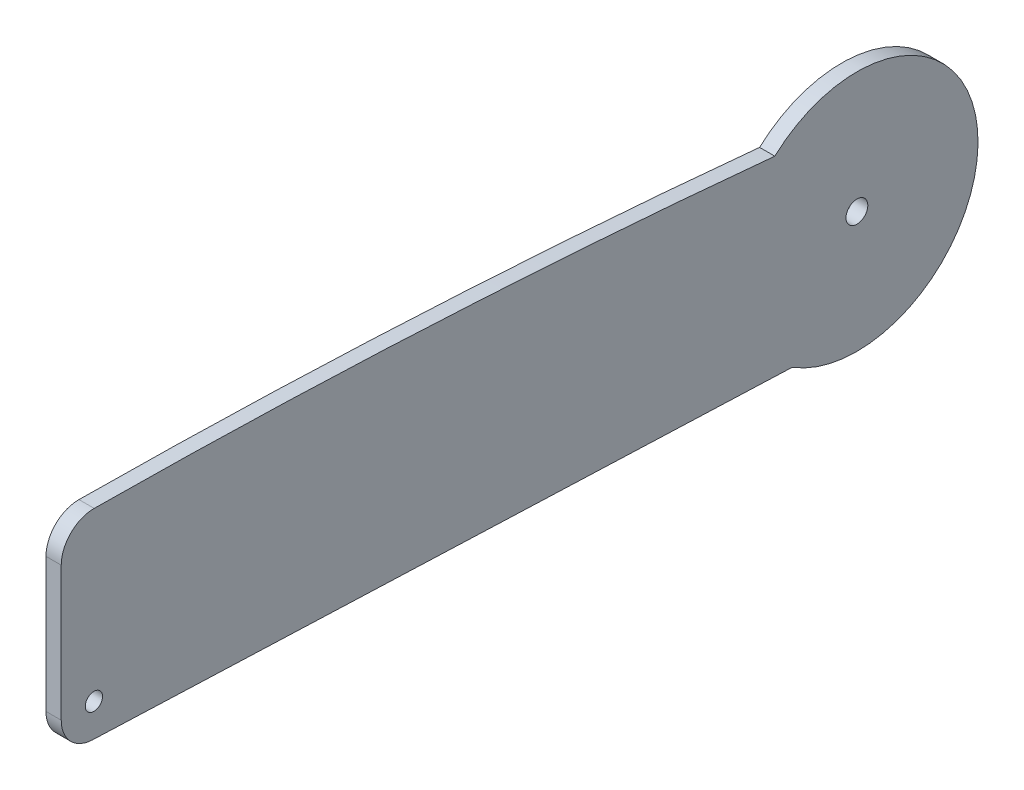
ISO-10303-21;
HEADER;
FILE_DESCRIPTION(('STEP AP214'),'2;1');
FILE_NAME('part.step','',(''),(''),'','','');
FILE_SCHEMA(('AUTOMOTIVE_DESIGN { 1 0 10303 214 1 1 1 1 }'));
ENDSEC;
DATA;
#1=APPLICATION_CONTEXT('core data for automotive mechanical design processes');
#2=APPLICATION_PROTOCOL_DEFINITION('international standard','automotive_design',2000,#1);
#3=PRODUCT_CONTEXT('',#1,'mechanical');
#4=PRODUCT('Part','Part','',(#3));
#5=PRODUCT_RELATED_PRODUCT_CATEGORY('part','',(#4));
#6=PRODUCT_DEFINITION_FORMATION('','',#4);
#7=PRODUCT_DEFINITION_CONTEXT('part definition',#1,'design');
#8=PRODUCT_DEFINITION('design','',#6,#7);
#9=PRODUCT_DEFINITION_SHAPE('','',#8);
#10=(LENGTH_UNIT() NAMED_UNIT(*) SI_UNIT(.MILLI.,.METRE.));
#11=(NAMED_UNIT(*) PLANE_ANGLE_UNIT() SI_UNIT($,.RADIAN.));
#12=(NAMED_UNIT(*) SI_UNIT($,.STERADIAN.) SOLID_ANGLE_UNIT());
#13=UNCERTAINTY_MEASURE_WITH_UNIT(LENGTH_MEASURE(1.E-05),#10,'distance_accuracy_value','');
#14=(GEOMETRIC_REPRESENTATION_CONTEXT(3) GLOBAL_UNCERTAINTY_ASSIGNED_CONTEXT((#13)) GLOBAL_UNIT_ASSIGNED_CONTEXT((#10,
#11,#12)) REPRESENTATION_CONTEXT('',''));
#15=CARTESIAN_POINT('',(0.,0.,0.));
#16=DIRECTION('',(0.,0.,1.));
#17=DIRECTION('',(1.,0.,0.));
#18=AXIS2_PLACEMENT_3D('',#15,#16,#17);
#19=CARTESIAN_POINT('',(5.588,-2797.93492372453,302.139392400577));
#20=DIRECTION('',(-1.,0.,0.));
#21=DIRECTION('',(0.,0.,1.));
#22=AXIS2_PLACEMENT_3D('',#19,#20,#21);
#23=PLANE('',#22);
#24=CARTESIAN_POINT('',(5.588,-2797.93492372453,302.139392400577));
#25=DIRECTION('',(1.,0.,0.));
#26=DIRECTION('',(0.,0.,1.));
#27=AXIS2_PLACEMENT_3D('',#24,#25,#26);
#28=CIRCLE('',#27,2843.65951940497);
#29=CARTESIAN_POINT('',(5.588,32.6847245832902,30.1249278657139));
#30=VERTEX_POINT('',#29);
#31=CARTESIAN_POINT('',(5.588,45.6376789125345,279.906177735358));
#32=VERTEX_POINT('',#31);
#33=EDGE_CURVE('E132',#30,#32,#28,.T.);
#34=ORIENTED_EDGE('',*,*,#33,.T.);
#35=CARTESIAN_POINT('',(5.588,33.6380456938623,280.));
#36=DIRECTION('',(1.,0.,0.));
#37=DIRECTION('',(0.,0.,1.));
#38=AXIS2_PLACEMENT_3D('',#35,#36,#37);
#39=CIRCLE('',#38,12.0000000000002);
#40=CARTESIAN_POINT('',(5.588,33.6380456938623,292.));
#41=VERTEX_POINT('',#40);
#42=EDGE_CURVE('E90',#32,#41,#39,.T.);
#43=ORIENTED_EDGE('',*,*,#42,.T.);
#44=DIRECTION('',(0.,-1.,0.));
#45=VECTOR('',#44,1.);
#46=CARTESIAN_POINT('',(5.588,33.6380456938623,292.));
#47=LINE('',#46,#45);
#48=CARTESIAN_POINT('',(5.588,-15.6483456588356,292.));
#49=VERTEX_POINT('',#48);
#50=EDGE_CURVE('E103',#41,#49,#47,.T.);
#51=ORIENTED_EDGE('',*,*,#50,.T.);
#52=CARTESIAN_POINT('',(5.588,-15.6483456588356,280.));
#53=DIRECTION('',(1.,0.,0.));
#54=DIRECTION('',(0.,0.,-1.));
#55=AXIS2_PLACEMENT_3D('',#52,#53,#54);
#56=CIRCLE('',#55,12.);
#57=CARTESIAN_POINT('',(5.588,-27.6392942563661,280.465995419916));
#58=VERTEX_POINT('',#57);
#59=EDGE_CURVE('E97',#49,#58,#56,.T.);
#60=ORIENTED_EDGE('',*,*,#59,.T.);
#61=DIRECTION('',(0.,-0.0388329516596948,-0.999245716460869));
#62=VECTOR('',#61,1.);
#63=CARTESIAN_POINT('',(5.588,-37.6186648290473,23.677807256581));
#64=LINE('',#63,#62);
#65=CARTESIAN_POINT('',(5.588,-37.6186648290473,23.677807256581));
#66=VERTEX_POINT('',#65);
#67=EDGE_CURVE('E101',#58,#66,#64,.T.);
#68=ORIENTED_EDGE('',*,*,#67,.T.);
#69=CARTESIAN_POINT('',(5.588,0.,0.));
#70=DIRECTION('',(1.,0.,0.));
#71=DIRECTION('',(0.,0.,-1.));
#72=AXIS2_PLACEMENT_3D('',#69,#70,#71);
#73=CIRCLE('',#72,44.45);
#74=EDGE_CURVE('E53',#66,#30,#73,.T.);
#75=ORIENTED_EDGE('',*,*,#74,.T.);
#76=EDGE_LOOP('',(#34,#43,#51,#60,#68,#75));
#77=FACE_BOUND('',#76,.T.);
#78=CARTESIAN_POINT('',(5.588,-15.6483456588356,280.));
#79=DIRECTION('',(1.,0.,0.));
#80=DIRECTION('',(0.,0.,-1.));
#81=AXIS2_PLACEMENT_3D('',#78,#79,#80);
#82=CIRCLE('',#81,3.17499999999997);
#83=CARTESIAN_POINT('',(5.588,-15.6483456588356,276.825));
#84=VERTEX_POINT('',#83);
#85=EDGE_CURVE('E125',#84,#84,#82,.T.);
#86=ORIENTED_EDGE('',*,*,#85,.F.);
#87=EDGE_LOOP('',(#86));
#88=FACE_BOUND('',#87,.T.);
#89=CARTESIAN_POINT('',(5.588,0.,0.));
#90=DIRECTION('',(1.,0.,0.));
#91=DIRECTION('',(0.,0.,-1.));
#92=AXIS2_PLACEMENT_3D('',#89,#90,#91);
#93=CIRCLE('',#92,4.);
#94=CARTESIAN_POINT('',(5.588,0.,-4.));
#95=VERTEX_POINT('',#94);
#96=EDGE_CURVE('E173',#95,#95,#93,.T.);
#97=ORIENTED_EDGE('',*,*,#96,.F.);
#98=EDGE_LOOP('',(#97));
#99=FACE_BOUND('',#98,.T.);
#100=ADVANCED_FACE('F36',(#77,#88,#99),#23,.F.);
#101=CARTESIAN_POINT('',(0.,-2797.93492372453,302.139392400577));
#102=DIRECTION('',(-1.,0.,0.));
#103=DIRECTION('',(0.,0.,1.));
#104=AXIS2_PLACEMENT_3D('',#101,#102,#103);
#105=PLANE('',#104);
#106=CARTESIAN_POINT('',(0.,-15.6483456588356,280.));
#107=DIRECTION('',(1.,0.,0.));
#108=DIRECTION('',(0.,0.,-1.));
#109=AXIS2_PLACEMENT_3D('',#106,#107,#108);
#110=CIRCLE('',#109,3.17499999999997);
#111=CARTESIAN_POINT('',(0.,-15.6483456588356,276.825));
#112=VERTEX_POINT('',#111);
#113=EDGE_CURVE('E178',#112,#112,#110,.T.);
#114=ORIENTED_EDGE('',*,*,#113,.T.);
#115=EDGE_LOOP('',(#114));
#116=FACE_BOUND('',#115,.T.);
#117=CARTESIAN_POINT('',(0.,-2797.93492372453,302.139392400577));
#118=DIRECTION('',(1.,0.,0.));
#119=DIRECTION('',(0.,0.,1.));
#120=AXIS2_PLACEMENT_3D('',#117,#118,#119);
#121=CIRCLE('',#120,2843.65951940497);
#122=CARTESIAN_POINT('',(0.,32.6847245832902,30.1249278657139));
#123=VERTEX_POINT('',#122);
#124=CARTESIAN_POINT('',(0.,45.6376789125345,279.906177735358));
#125=VERTEX_POINT('',#124);
#126=EDGE_CURVE('E121',#123,#125,#121,.T.);
#127=ORIENTED_EDGE('',*,*,#126,.F.);
#128=CARTESIAN_POINT('',(0.,0.,0.));
#129=DIRECTION('',(1.,0.,0.));
#130=DIRECTION('',(0.,0.,-1.));
#131=AXIS2_PLACEMENT_3D('',#128,#129,#130);
#132=CIRCLE('',#131,44.45);
#133=CARTESIAN_POINT('',(0.,-37.6186648290473,23.677807256581));
#134=VERTEX_POINT('',#133);
#135=EDGE_CURVE('E82',#134,#123,#132,.T.);
#136=ORIENTED_EDGE('',*,*,#135,.F.);
#137=DIRECTION('',(0.,-0.0388329516596948,-0.999245716460869));
#138=VECTOR('',#137,1.);
#139=CARTESIAN_POINT('',(0.,-37.6186648290473,23.677807256581));
#140=LINE('',#139,#138);
#141=CARTESIAN_POINT('',(0.,-27.6392942563661,280.465995419916));
#142=VERTEX_POINT('',#141);
#143=EDGE_CURVE('E76',#142,#134,#140,.T.);
#144=ORIENTED_EDGE('',*,*,#143,.F.);
#145=CARTESIAN_POINT('',(0.,-15.6483456588356,280.));
#146=DIRECTION('',(1.,0.,0.));
#147=DIRECTION('',(0.,0.,-1.));
#148=AXIS2_PLACEMENT_3D('',#145,#146,#147);
#149=CIRCLE('',#148,12.);
#150=CARTESIAN_POINT('',(0.,-15.6483456588356,292.));
#151=VERTEX_POINT('',#150);
#152=EDGE_CURVE('E111',#151,#142,#149,.T.);
#153=ORIENTED_EDGE('',*,*,#152,.F.);
#154=DIRECTION('',(0.,-1.,0.));
#155=VECTOR('',#154,1.);
#156=CARTESIAN_POINT('',(0.,33.6380456938623,292.));
#157=LINE('',#156,#155);
#158=CARTESIAN_POINT('',(0.,33.6380456938623,292.));
#159=VERTEX_POINT('',#158);
#160=EDGE_CURVE('E127',#159,#151,#157,.T.);
#161=ORIENTED_EDGE('',*,*,#160,.F.);
#162=CARTESIAN_POINT('',(0.,33.6380456938623,280.));
#163=DIRECTION('',(1.,0.,0.));
#164=DIRECTION('',(0.,0.,1.));
#165=AXIS2_PLACEMENT_3D('',#162,#163,#164);
#166=CIRCLE('',#165,12.0000000000002);
#167=EDGE_CURVE('E124',#125,#159,#166,.T.);
#168=ORIENTED_EDGE('',*,*,#167,.F.);
#169=EDGE_LOOP('',(#127,#136,#144,#153,#161,#168));
#170=FACE_BOUND('',#169,.T.);
#171=CARTESIAN_POINT('',(0.,0.,0.));
#172=DIRECTION('',(1.,0.,0.));
#173=DIRECTION('',(0.,0.,-1.));
#174=AXIS2_PLACEMENT_3D('',#171,#172,#173);
#175=CIRCLE('',#174,4.);
#176=CARTESIAN_POINT('',(0.,0.,-4.));
#177=VERTEX_POINT('',#176);
#178=EDGE_CURVE('E176',#177,#177,#175,.T.);
#179=ORIENTED_EDGE('',*,*,#178,.T.);
#180=EDGE_LOOP('',(#179));
#181=FACE_BOUND('',#180,.T.);
#182=ADVANCED_FACE('F141',(#116,#170,#181),#105,.T.);
#183=CARTESIAN_POINT('',(5.588,-2797.93492372453,302.139392400577));
#184=DIRECTION('',(-1.,0.,0.));
#185=DIRECTION('',(0.,0.,1.));
#186=AXIS2_PLACEMENT_3D('',#183,#184,#185);
#187=CYLINDRICAL_SURFACE('',#186,2843.65951940497);
#188=ORIENTED_EDGE('',*,*,#126,.T.);
#189=DIRECTION('',(-1.,0.,0.));
#190=VECTOR('',#189,1.);
#191=CARTESIAN_POINT('',(5.588,45.6376789125345,279.906177735358));
#192=LINE('',#191,#190);
#193=EDGE_CURVE('E11',#32,#125,#192,.T.);
#194=ORIENTED_EDGE('',*,*,#193,.F.);
#195=ORIENTED_EDGE('',*,*,#33,.F.);
#196=DIRECTION('',(-1.,0.,0.));
#197=VECTOR('',#196,1.);
#198=CARTESIAN_POINT('',(5.588,32.6847245832902,30.1249278657139));
#199=LINE('',#198,#197);
#200=EDGE_CURVE('E117',#30,#123,#199,.T.);
#201=ORIENTED_EDGE('',*,*,#200,.T.);
#202=EDGE_LOOP('',(#188,#194,#195,#201));
#203=FACE_BOUND('',#202,.T.);
#204=ADVANCED_FACE('F38',(#203),#187,.T.);
#205=CARTESIAN_POINT('',(5.588,33.6380456938623,280.));
#206=DIRECTION('',(-1.,0.,0.));
#207=DIRECTION('',(0.,0.,1.));
#208=AXIS2_PLACEMENT_3D('',#205,#206,#207);
#209=CYLINDRICAL_SURFACE('',#208,12.0000000000002);
#210=ORIENTED_EDGE('',*,*,#167,.T.);
#211=DIRECTION('',(-1.,0.,0.));
#212=VECTOR('',#211,1.);
#213=CARTESIAN_POINT('',(5.588,33.6380456938623,292.));
#214=LINE('',#213,#212);
#215=EDGE_CURVE('E45',#41,#159,#214,.T.);
#216=ORIENTED_EDGE('',*,*,#215,.F.);
#217=ORIENTED_EDGE('',*,*,#42,.F.);
#218=ORIENTED_EDGE('',*,*,#193,.T.);
#219=EDGE_LOOP('',(#210,#216,#217,#218));
#220=FACE_BOUND('',#219,.T.);
#221=ADVANCED_FACE('F221',(#220),#209,.T.);
#222=CARTESIAN_POINT('',(5.588,33.6380456938623,292.));
#223=DIRECTION('',(0.,0.,-1.));
#224=DIRECTION('',(0.,1.,0.));
#225=AXIS2_PLACEMENT_3D('',#222,#223,#224);
#226=PLANE('',#225);
#227=ORIENTED_EDGE('',*,*,#160,.T.);
#228=DIRECTION('',(-1.,0.,0.));
#229=VECTOR('',#228,1.);
#230=CARTESIAN_POINT('',(5.588,-15.6483456588356,292.));
#231=LINE('',#230,#229);
#232=EDGE_CURVE('E112',#49,#151,#231,.T.);
#233=ORIENTED_EDGE('',*,*,#232,.F.);
#234=ORIENTED_EDGE('',*,*,#50,.F.);
#235=ORIENTED_EDGE('',*,*,#215,.T.);
#236=EDGE_LOOP('',(#227,#233,#234,#235));
#237=FACE_BOUND('',#236,.T.);
#238=ADVANCED_FACE('F138',(#237),#226,.F.);
#239=CARTESIAN_POINT('',(5.588,-15.6483456588356,280.));
#240=DIRECTION('',(-1.,0.,0.));
#241=DIRECTION('',(0.,0.,1.));
#242=AXIS2_PLACEMENT_3D('',#239,#240,#241);
#243=CYLINDRICAL_SURFACE('',#242,12.);
#244=ORIENTED_EDGE('',*,*,#152,.T.);
#245=DIRECTION('',(-1.,0.,0.));
#246=VECTOR('',#245,1.);
#247=CARTESIAN_POINT('',(5.588,-27.6392942563661,280.465995419916));
#248=LINE('',#247,#246);
#249=EDGE_CURVE('E108',#58,#142,#248,.T.);
#250=ORIENTED_EDGE('',*,*,#249,.F.);
#251=ORIENTED_EDGE('',*,*,#59,.F.);
#252=ORIENTED_EDGE('',*,*,#232,.T.);
#253=EDGE_LOOP('',(#244,#250,#251,#252));
#254=FACE_BOUND('',#253,.T.);
#255=ADVANCED_FACE('F109',(#254),#243,.T.);
#256=CARTESIAN_POINT('',(5.588,-37.6186648290473,23.677807256581));
#257=DIRECTION('',(0.,0.999245716460869,-0.0388329516596948));
#258=DIRECTION('',(0.,0.0388329516596948,0.999245716460869));
#259=AXIS2_PLACEMENT_3D('',#256,#257,#258);
#260=PLANE('',#259);
#261=ORIENTED_EDGE('',*,*,#143,.T.);
#262=DIRECTION('',(-1.,0.,0.));
#263=VECTOR('',#262,1.);
#264=CARTESIAN_POINT('',(5.588,-37.6186648290473,23.677807256581));
#265=LINE('',#264,#263);
#266=EDGE_CURVE('E113',#66,#134,#265,.T.);
#267=ORIENTED_EDGE('',*,*,#266,.F.);
#268=ORIENTED_EDGE('',*,*,#67,.F.);
#269=ORIENTED_EDGE('',*,*,#249,.T.);
#270=EDGE_LOOP('',(#261,#267,#268,#269));
#271=FACE_BOUND('',#270,.T.);
#272=ADVANCED_FACE('F115',(#271),#260,.F.);
#273=CARTESIAN_POINT('',(5.588,0.,0.));
#274=DIRECTION('',(-1.,0.,0.));
#275=DIRECTION('',(0.,0.,1.));
#276=AXIS2_PLACEMENT_3D('',#273,#274,#275);
#277=CYLINDRICAL_SURFACE('',#276,44.45);
#278=ORIENTED_EDGE('',*,*,#135,.T.);
#279=ORIENTED_EDGE('',*,*,#200,.F.);
#280=ORIENTED_EDGE('',*,*,#74,.F.);
#281=ORIENTED_EDGE('',*,*,#266,.T.);
#282=EDGE_LOOP('',(#278,#279,#280,#281));
#283=FACE_BOUND('',#282,.T.);
#284=ADVANCED_FACE('F146',(#283),#277,.T.);
#285=CARTESIAN_POINT('',(5.588,-15.6483456588356,280.));
#286=DIRECTION('',(-1.,0.,0.));
#287=DIRECTION('',(0.,0.,1.));
#288=AXIS2_PLACEMENT_3D('',#285,#286,#287);
#289=CYLINDRICAL_SURFACE('',#288,3.17499999999997);
#290=ORIENTED_EDGE('',*,*,#85,.T.);
#291=EDGE_LOOP('',(#290));
#292=FACE_BOUND('',#291,.T.);
#293=ORIENTED_EDGE('',*,*,#113,.F.);
#294=EDGE_LOOP('',(#293));
#295=FACE_BOUND('',#294,.T.);
#296=ADVANCED_FACE('F148',(#292,#295),#289,.F.);
#297=CARTESIAN_POINT('',(5.588,0.,0.));
#298=DIRECTION('',(-1.,0.,0.));
#299=DIRECTION('',(0.,0.,1.));
#300=AXIS2_PLACEMENT_3D('',#297,#298,#299);
#301=CYLINDRICAL_SURFACE('',#300,4.);
#302=ORIENTED_EDGE('',*,*,#96,.T.);
#303=EDGE_LOOP('',(#302));
#304=FACE_BOUND('',#303,.T.);
#305=ORIENTED_EDGE('',*,*,#178,.F.);
#306=EDGE_LOOP('',(#305));
#307=FACE_BOUND('',#306,.T.);
#308=ADVANCED_FACE('F154',(#304,#307),#301,.F.);
#309=CLOSED_SHELL('',(#100,#182,#204,#221,#238,#255,#272,#284,#296,#308));
#310=MANIFOLD_SOLID_BREP('B2',#309);
#311=ADVANCED_BREP_SHAPE_REPRESENTATION('',(#18,#310),#14);
#312=SHAPE_DEFINITION_REPRESENTATION(#9,#311);
ENDSEC;
END-ISO-10303-21;
